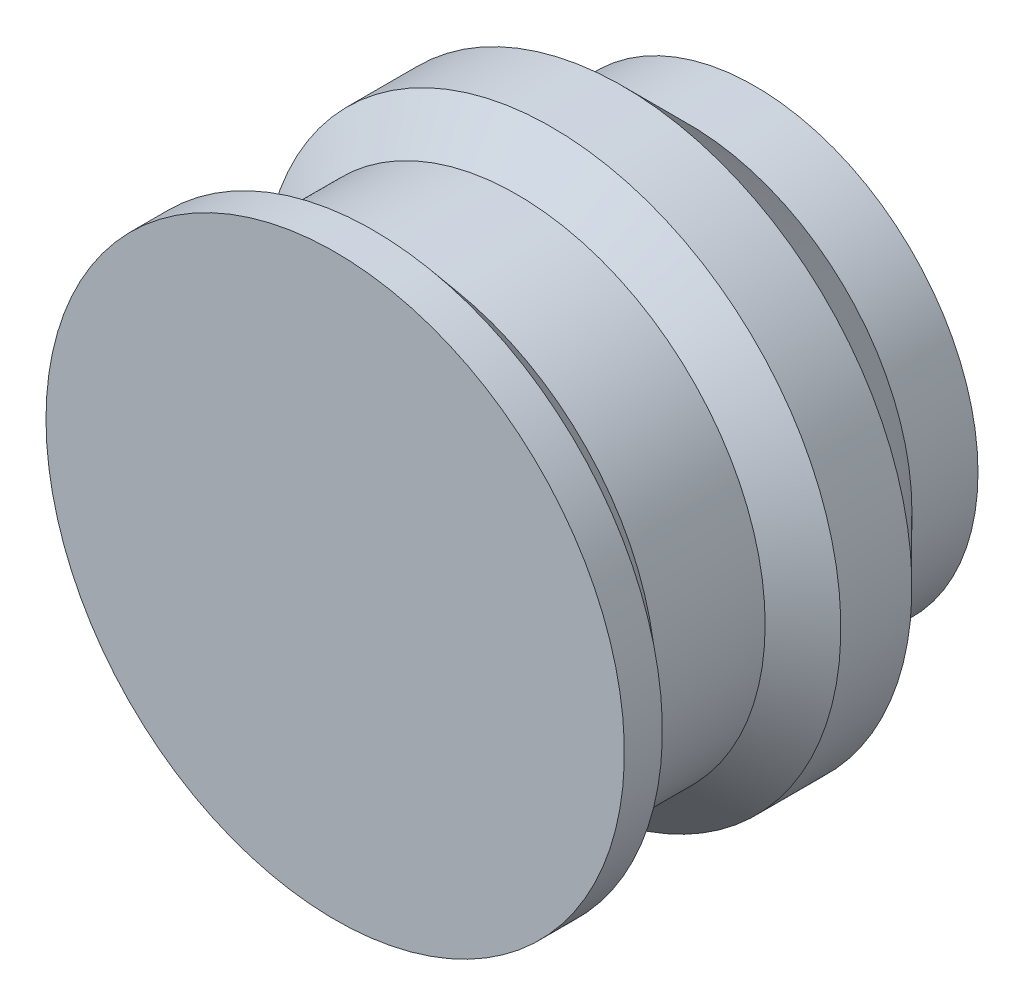
ISO-10303-21;
HEADER;
FILE_DESCRIPTION(('STEP AP214'),'2;1');
FILE_NAME('part.step','',(''),(''),'','','');
FILE_SCHEMA(('AUTOMOTIVE_DESIGN { 1 0 10303 214 1 1 1 1 }'));
ENDSEC;
DATA;
#1=APPLICATION_CONTEXT('core data for automotive mechanical design processes');
#2=APPLICATION_PROTOCOL_DEFINITION('international standard','automotive_design',2000,#1);
#3=PRODUCT_CONTEXT('',#1,'mechanical');
#4=PRODUCT('Part','Part','',(#3));
#5=PRODUCT_RELATED_PRODUCT_CATEGORY('part','',(#4));
#6=PRODUCT_DEFINITION_FORMATION('','',#4);
#7=PRODUCT_DEFINITION_CONTEXT('part definition',#1,'design');
#8=PRODUCT_DEFINITION('design','',#6,#7);
#9=PRODUCT_DEFINITION_SHAPE('','',#8);
#10=(LENGTH_UNIT() NAMED_UNIT(*) SI_UNIT(.MILLI.,.METRE.));
#11=(NAMED_UNIT(*) PLANE_ANGLE_UNIT() SI_UNIT($,.RADIAN.));
#12=(NAMED_UNIT(*) SI_UNIT($,.STERADIAN.) SOLID_ANGLE_UNIT());
#13=UNCERTAINTY_MEASURE_WITH_UNIT(LENGTH_MEASURE(1.E-05),#10,'distance_accuracy_value','');
#14=(GEOMETRIC_REPRESENTATION_CONTEXT(3) GLOBAL_UNCERTAINTY_ASSIGNED_CONTEXT((#13)) GLOBAL_UNIT_ASSIGNED_CONTEXT((#10,
#11,#12)) REPRESENTATION_CONTEXT('',''));
#15=CARTESIAN_POINT('',(0.,0.,0.));
#16=DIRECTION('',(0.,0.,1.));
#17=DIRECTION('',(1.,0.,0.));
#18=AXIS2_PLACEMENT_3D('',#15,#16,#17);
#19=CARTESIAN_POINT('',(0.,0.,3.85));
#20=DIRECTION('',(0.,0.,1.));
#21=DIRECTION('',(1.,0.,0.));
#22=AXIS2_PLACEMENT_3D('',#19,#20,#21);
#23=CYLINDRICAL_SURFACE('',#22,7.51);
#24=CARTESIAN_POINT('',(0.,0.,5.5));
#25=DIRECTION('',(0.,0.,1.));
#26=DIRECTION('',(1.,0.,0.));
#27=AXIS2_PLACEMENT_3D('',#24,#25,#26);
#28=CIRCLE('',#27,7.51);
#29=CARTESIAN_POINT('',(-7.51,0.,5.5));
#30=VERTEX_POINT('',#29);
#31=EDGE_CURVE('E169',#30,#30,#28,.T.);
#32=ORIENTED_EDGE('',*,*,#31,.F.);
#33=DIRECTION('',(0.,0.,-1.));
#34=VECTOR('',#33,1.);
#35=CARTESIAN_POINT('',(-7.51,0.,3.85));
#36=LINE('',#35,#34);
#37=CARTESIAN_POINT('',(-7.51,0.,2.2));
#38=VERTEX_POINT('',#37);
#39=EDGE_CURVE('E9',#30,#38,#36,.T.);
#40=ORIENTED_EDGE('',*,*,#39,.T.);
#41=CARTESIAN_POINT('',(0.,0.,2.2));
#42=DIRECTION('',(0.,0.,1.));
#43=DIRECTION('',(1.,0.,0.));
#44=AXIS2_PLACEMENT_3D('',#41,#42,#43);
#45=CIRCLE('',#44,7.51);
#46=EDGE_CURVE('E178',#38,#38,#45,.T.);
#47=ORIENTED_EDGE('',*,*,#46,.T.);
#48=ORIENTED_EDGE('',*,*,#39,.F.);
#49=EDGE_LOOP('',(#32,#40,#47,#48));
#50=FACE_BOUND('',#49,.T.);
#51=ADVANCED_FACE('F15',(#50),#23,.T.);
#52=CARTESIAN_POINT('',(0.,0.,1.675));
#53=DIRECTION('',(0.,0.,-1.));
#54=DIRECTION('',(1.,0.,0.));
#55=AXIS2_PLACEMENT_3D('',#52,#53,#54);
#56=CONICAL_SURFACE('',#55,8.13,0.86817799306093);
#57=ORIENTED_EDGE('',*,*,#46,.F.);
#58=DIRECTION('',(-0.763152790557396,0.,-0.64621808877844));
#59=VECTOR('',#58,1.);
#60=CARTESIAN_POINT('',(-8.13,0.,1.675));
#61=LINE('',#60,#59);
#62=CARTESIAN_POINT('',(-8.75,0.,1.15));
#63=VERTEX_POINT('',#62);
#64=EDGE_CURVE('E26',#38,#63,#61,.T.);
#65=ORIENTED_EDGE('',*,*,#64,.T.);
#66=CARTESIAN_POINT('',(0.,0.,1.15));
#67=DIRECTION('',(0.,0.,1.));
#68=DIRECTION('',(1.,0.,0.));
#69=AXIS2_PLACEMENT_3D('',#66,#67,#68);
#70=CIRCLE('',#69,8.75);
#71=EDGE_CURVE('E150',#63,#63,#70,.T.);
#72=ORIENTED_EDGE('',*,*,#71,.T.);
#73=ORIENTED_EDGE('',*,*,#64,.F.);
#74=EDGE_LOOP('',(#57,#65,#72,#73));
#75=FACE_BOUND('',#74,.T.);
#76=ADVANCED_FACE('F221',(#75),#56,.T.);
#77=CARTESIAN_POINT('',(0.,0.,7.7));
#78=DIRECTION('',(0.,0.,1.));
#79=DIRECTION('',(1.,0.,0.));
#80=AXIS2_PLACEMENT_3D('',#77,#78,#79);
#81=PLANE('',#80);
#82=CARTESIAN_POINT('',(0.,0.,7.7));
#83=DIRECTION('',(0.,0.,1.));
#84=DIRECTION('',(1.,0.,0.));
#85=AXIS2_PLACEMENT_3D('',#82,#83,#84);
#86=CIRCLE('',#85,8.75);
#87=CARTESIAN_POINT('',(-8.75,0.,7.7));
#88=VERTEX_POINT('',#87);
#89=EDGE_CURVE('E165',#88,#88,#86,.T.);
#90=ORIENTED_EDGE('',*,*,#89,.T.);
#91=EDGE_LOOP('',(#90));
#92=FACE_BOUND('',#91,.T.);
#93=ADVANCED_FACE('F17',(#92),#81,.T.);
#94=CARTESIAN_POINT('',(0.,0.,7.125));
#95=DIRECTION('',(0.,0.,1.));
#96=DIRECTION('',(1.,0.,0.));
#97=AXIS2_PLACEMENT_3D('',#94,#95,#96);
#98=CYLINDRICAL_SURFACE('',#97,8.75);
#99=ORIENTED_EDGE('',*,*,#89,.F.);
#100=DIRECTION('',(0.,0.,-1.));
#101=VECTOR('',#100,1.);
#102=CARTESIAN_POINT('',(-8.75,0.,7.125));
#103=LINE('',#102,#101);
#104=CARTESIAN_POINT('',(-8.75,0.,6.55));
#105=VERTEX_POINT('',#104);
#106=EDGE_CURVE('E168',#88,#105,#103,.T.);
#107=ORIENTED_EDGE('',*,*,#106,.T.);
#108=CARTESIAN_POINT('',(0.,0.,6.55));
#109=DIRECTION('',(0.,0.,1.));
#110=DIRECTION('',(1.,0.,0.));
#111=AXIS2_PLACEMENT_3D('',#108,#109,#110);
#112=CIRCLE('',#111,8.75);
#113=EDGE_CURVE('E171',#105,#105,#112,.T.);
#114=ORIENTED_EDGE('',*,*,#113,.T.);
#115=ORIENTED_EDGE('',*,*,#106,.F.);
#116=EDGE_LOOP('',(#99,#107,#114,#115));
#117=FACE_BOUND('',#116,.T.);
#118=ADVANCED_FACE('F229',(#117),#98,.T.);
#119=CARTESIAN_POINT('',(0.,0.,6.025));
#120=DIRECTION('',(0.,0.,1.));
#121=DIRECTION('',(1.,0.,0.));
#122=AXIS2_PLACEMENT_3D('',#119,#120,#121);
#123=CONICAL_SURFACE('',#122,8.13,0.86817799306093);
#124=ORIENTED_EDGE('',*,*,#113,.F.);
#125=DIRECTION('',(0.763152790557396,0.,-0.64621808877844));
#126=VECTOR('',#125,1.);
#127=CARTESIAN_POINT('',(-8.13,0.,6.025));
#128=LINE('',#127,#126);
#129=EDGE_CURVE('E175',#105,#30,#128,.T.);
#130=ORIENTED_EDGE('',*,*,#129,.T.);
#131=ORIENTED_EDGE('',*,*,#31,.T.);
#132=ORIENTED_EDGE('',*,*,#129,.F.);
#133=EDGE_LOOP('',(#124,#130,#131,#132));
#134=FACE_BOUND('',#133,.T.);
#135=ADVANCED_FACE('F251',(#134),#123,.T.);
#136=CARTESIAN_POINT('',(-1.9,-1.9245,-3.));
#137=DIRECTION('',(-1.,0.,0.));
#138=DIRECTION('',(0.,1.,0.));
#139=AXIS2_PLACEMENT_3D('',#136,#137,#138);
#140=PLANE('',#139);
#141=DIRECTION('',(0.,-1.,0.));
#142=VECTOR('',#141,1.);
#143=CARTESIAN_POINT('',(-1.9,-0.96225,2.));
#144=LINE('',#143,#142);
#145=CARTESIAN_POINT('',(-1.9,1.9245,2.));
#146=VERTEX_POINT('',#145);
#147=CARTESIAN_POINT('',(-1.9,-1.9245,2.));
#148=VERTEX_POINT('',#147);
#149=EDGE_CURVE('E125',#146,#148,#144,.T.);
#150=ORIENTED_EDGE('',*,*,#149,.T.);
#151=DIRECTION('',(0.,0.,-1.));
#152=VECTOR('',#151,1.);
#153=CARTESIAN_POINT('',(-1.9,-1.9245,-3.));
#154=LINE('',#153,#152);
#155=CARTESIAN_POINT('',(-1.9,-1.9245,-5.));
#156=VERTEX_POINT('',#155);
#157=EDGE_CURVE('E118',#148,#156,#154,.T.);
#158=ORIENTED_EDGE('',*,*,#157,.T.);
#159=DIRECTION('',(0.,-1.,0.));
#160=VECTOR('',#159,1.);
#161=CARTESIAN_POINT('',(-1.9,-0.96225,-5.));
#162=LINE('',#161,#160);
#163=CARTESIAN_POINT('',(-1.9,1.9245,-5.));
#164=VERTEX_POINT('',#163);
#165=EDGE_CURVE('E91',#164,#156,#162,.T.);
#166=ORIENTED_EDGE('',*,*,#165,.F.);
#167=DIRECTION('',(0.,0.,1.));
#168=VECTOR('',#167,1.);
#169=CARTESIAN_POINT('',(-1.9,1.9245,-3.));
#170=LINE('',#169,#168);
#171=EDGE_CURVE('E135',#164,#146,#170,.T.);
#172=ORIENTED_EDGE('',*,*,#171,.T.);
#173=EDGE_LOOP('',(#150,#158,#166,#172));
#174=FACE_BOUND('',#173,.T.);
#175=ADVANCED_FACE('F243',(#174),#140,.F.);
#176=CARTESIAN_POINT('',(0.,-0.398741887905605,-3.));
#177=DIRECTION('',(0.,0.,-1.));
#178=DIRECTION('',(-0.633071265484004,0.774093516843077,0.));
#179=AXIS2_PLACEMENT_3D('',#176,#177,#178);
#180=CYLINDRICAL_SURFACE('',#179,3.0012418879056);
#181=CARTESIAN_POINT('',(0.,-0.398741887905605,2.));
#182=DIRECTION('',(0.,0.,1.));
#183=DIRECTION('',(-0.633071265484004,0.774093516843077,0.));
#184=AXIS2_PLACEMENT_3D('',#181,#182,#183);
#185=CIRCLE('',#184,3.0012418879056);
#186=CARTESIAN_POINT('',(1.9,1.9245,2.));
#187=VERTEX_POINT('',#186);
#188=EDGE_CURVE('E158',#187,#146,#185,.T.);
#189=ORIENTED_EDGE('',*,*,#188,.T.);
#190=ORIENTED_EDGE('',*,*,#171,.F.);
#191=CARTESIAN_POINT('',(0.,-0.398741887905605,-5.));
#192=DIRECTION('',(0.,0.,1.));
#193=DIRECTION('',(-0.633071265484004,0.774093516843077,0.));
#194=AXIS2_PLACEMENT_3D('',#191,#192,#193);
#195=CIRCLE('',#194,3.0012418879056);
#196=CARTESIAN_POINT('',(1.9,1.9245,-5.));
#197=VERTEX_POINT('',#196);
#198=EDGE_CURVE('E144',#197,#164,#195,.T.);
#199=ORIENTED_EDGE('',*,*,#198,.F.);
#200=DIRECTION('',(0.,0.,-1.));
#201=VECTOR('',#200,1.);
#202=CARTESIAN_POINT('',(1.9,1.9245,-3.));
#203=LINE('',#202,#201);
#204=EDGE_CURVE('E109',#187,#197,#203,.T.);
#205=ORIENTED_EDGE('',*,*,#204,.F.);
#206=EDGE_LOOP('',(#189,#190,#199,#205));
#207=FACE_BOUND('',#206,.T.);
#208=ADVANCED_FACE('F240',(#207),#180,.F.);
#209=CARTESIAN_POINT('',(0.,0.,0.575));
#210=DIRECTION('',(0.,0.,1.));
#211=DIRECTION('',(1.,0.,0.));
#212=AXIS2_PLACEMENT_3D('',#209,#210,#211);
#213=CYLINDRICAL_SURFACE('',#212,8.75);
#214=ORIENTED_EDGE('',*,*,#71,.F.);
#215=DIRECTION('',(0.,0.,-1.));
#216=VECTOR('',#215,1.);
#217=CARTESIAN_POINT('',(-8.75,0.,0.575));
#218=LINE('',#217,#216);
#219=CARTESIAN_POINT('',(-8.75,0.,-1.));
#220=VERTEX_POINT('',#219);
#221=EDGE_CURVE('E154',#63,#220,#218,.T.);
#222=ORIENTED_EDGE('',*,*,#221,.T.);
#223=CARTESIAN_POINT('',(0.,0.,-1.));
#224=DIRECTION('',(0.,0.,-1.));
#225=DIRECTION('',(1.,0.,0.));
#226=AXIS2_PLACEMENT_3D('',#223,#224,#225);
#227=CIRCLE('',#226,8.75);
#228=EDGE_CURVE('E139',#220,#220,#227,.T.);
#229=ORIENTED_EDGE('',*,*,#228,.F.);
#230=ORIENTED_EDGE('',*,*,#221,.F.);
#231=EDGE_LOOP('',(#214,#222,#229,#230));
#232=FACE_BOUND('',#231,.T.);
#233=ADVANCED_FACE('F219',(#232),#213,.T.);
#234=CARTESIAN_POINT('',(0.,0.,-2.));
#235=DIRECTION('',(0.,0.,1.));
#236=DIRECTION('',(1.,0.,0.));
#237=AXIS2_PLACEMENT_3D('',#234,#235,#236);
#238=CONICAL_SURFACE('',#237,7.75,0.785398163397448);
#239=ORIENTED_EDGE('',*,*,#228,.T.);
#240=DIRECTION('',(0.707106781186547,0.,-0.707106781186548));
#241=VECTOR('',#240,1.);
#242=CARTESIAN_POINT('',(-7.75,0.,-2.));
#243=LINE('',#242,#241);
#244=CARTESIAN_POINT('',(-6.75,0.,-3.));
#245=VERTEX_POINT('',#244);
#246=EDGE_CURVE('E143',#220,#245,#243,.T.);
#247=ORIENTED_EDGE('',*,*,#246,.T.);
#248=CARTESIAN_POINT('',(0.,0.,-3.));
#249=DIRECTION('',(0.,0.,1.));
#250=DIRECTION('',(1.,0.,0.));
#251=AXIS2_PLACEMENT_3D('',#248,#249,#250);
#252=CIRCLE('',#251,6.75);
#253=EDGE_CURVE('E145',#245,#245,#252,.T.);
#254=ORIENTED_EDGE('',*,*,#253,.T.);
#255=ORIENTED_EDGE('',*,*,#246,.F.);
#256=EDGE_LOOP('',(#239,#247,#254,#255));
#257=FACE_BOUND('',#256,.T.);
#258=ADVANCED_FACE('F211',(#257),#238,.T.);
#259=CARTESIAN_POINT('',(8.75,0.,-5.));
#260=DIRECTION('',(0.,0.,-1.));
#261=DIRECTION('',(0.,-1.,0.));
#262=AXIS2_PLACEMENT_3D('',#259,#260,#261);
#263=PLANE('',#262);
#264=ORIENTED_EDGE('',*,*,#165,.T.);
#265=CARTESIAN_POINT('',(0.,0.398741887905603,-5.));
#266=DIRECTION('',(0.,0.,1.));
#267=DIRECTION('',(0.633071265484003,-0.774093516843077,0.));
#268=AXIS2_PLACEMENT_3D('',#265,#266,#267);
#269=CIRCLE('',#268,3.0012418879056);
#270=CARTESIAN_POINT('',(1.9,-1.9245,-5.));
#271=VERTEX_POINT('',#270);
#272=EDGE_CURVE('E113',#156,#271,#269,.T.);
#273=ORIENTED_EDGE('',*,*,#272,.T.);
#274=DIRECTION('',(0.,1.,0.));
#275=VECTOR('',#274,1.);
#276=CARTESIAN_POINT('',(1.9,0.96225,-5.));
#277=LINE('',#276,#275);
#278=EDGE_CURVE('E102',#271,#197,#277,.T.);
#279=ORIENTED_EDGE('',*,*,#278,.T.);
#280=ORIENTED_EDGE('',*,*,#198,.T.);
#281=EDGE_LOOP('',(#264,#273,#279,#280));
#282=FACE_BOUND('',#281,.T.);
#283=CARTESIAN_POINT('',(0.,0.,-5.));
#284=DIRECTION('',(0.,0.,-1.));
#285=DIRECTION('',(1.,0.,0.));
#286=AXIS2_PLACEMENT_3D('',#283,#284,#285);
#287=CIRCLE('',#286,6.75);
#288=CARTESIAN_POINT('',(-6.75,0.,-5.));
#289=VERTEX_POINT('',#288);
#290=EDGE_CURVE('E19',#289,#289,#287,.T.);
#291=ORIENTED_EDGE('',*,*,#290,.T.);
#292=EDGE_LOOP('',(#291));
#293=FACE_BOUND('',#292,.T.);
#294=ADVANCED_FACE('F114',(#282,#293),#263,.T.);
#295=CARTESIAN_POINT('',(0.,0.,-3.));
#296=DIRECTION('',(0.,0.,-1.));
#297=DIRECTION('',(1.,0.,0.));
#298=AXIS2_PLACEMENT_3D('',#295,#296,#297);
#299=CYLINDRICAL_SURFACE('',#298,6.75);
#300=ORIENTED_EDGE('',*,*,#290,.F.);
#301=DIRECTION('',(0.,0.,1.));
#302=VECTOR('',#301,1.);
#303=CARTESIAN_POINT('',(-6.75,0.,-3.));
#304=LINE('',#303,#302);
#305=EDGE_CURVE('E148',#289,#245,#304,.T.);
#306=ORIENTED_EDGE('',*,*,#305,.T.);
#307=ORIENTED_EDGE('',*,*,#253,.F.);
#308=ORIENTED_EDGE('',*,*,#305,.F.);
#309=EDGE_LOOP('',(#300,#306,#307,#308));
#310=FACE_BOUND('',#309,.T.);
#311=ADVANCED_FACE('F234',(#310),#299,.T.);
#312=CARTESIAN_POINT('',(1.9,1.9245,-3.));
#313=DIRECTION('',(1.,0.,0.));
#314=DIRECTION('',(0.,-1.,0.));
#315=AXIS2_PLACEMENT_3D('',#312,#313,#314);
#316=PLANE('',#315);
#317=DIRECTION('',(0.,1.,0.));
#318=VECTOR('',#317,1.);
#319=CARTESIAN_POINT('',(1.9,0.96225,2.));
#320=LINE('',#319,#318);
#321=CARTESIAN_POINT('',(1.9,-1.9245,2.));
#322=VERTEX_POINT('',#321);
#323=EDGE_CURVE('E155',#322,#187,#320,.T.);
#324=ORIENTED_EDGE('',*,*,#323,.T.);
#325=ORIENTED_EDGE('',*,*,#204,.T.);
#326=ORIENTED_EDGE('',*,*,#278,.F.);
#327=DIRECTION('',(0.,0.,-1.));
#328=VECTOR('',#327,1.);
#329=CARTESIAN_POINT('',(1.9,-1.9245,-3.));
#330=LINE('',#329,#328);
#331=EDGE_CURVE('E106',#322,#271,#330,.T.);
#332=ORIENTED_EDGE('',*,*,#331,.F.);
#333=EDGE_LOOP('',(#324,#325,#326,#332));
#334=FACE_BOUND('',#333,.T.);
#335=ADVANCED_FACE('F104',(#334),#316,.F.);
#336=CARTESIAN_POINT('',(0.,0.398741887905603,-3.));
#337=DIRECTION('',(0.,0.,-1.));
#338=DIRECTION('',(0.633071265484003,-0.774093516843077,0.));
#339=AXIS2_PLACEMENT_3D('',#336,#337,#338);
#340=CYLINDRICAL_SURFACE('',#339,3.0012418879056);
#341=CARTESIAN_POINT('',(0.,0.398741887905603,2.));
#342=DIRECTION('',(0.,0.,1.));
#343=DIRECTION('',(0.633071265484003,-0.774093516843077,0.));
#344=AXIS2_PLACEMENT_3D('',#341,#342,#343);
#345=CIRCLE('',#344,3.0012418879056);
#346=EDGE_CURVE('E122',#148,#322,#345,.T.);
#347=ORIENTED_EDGE('',*,*,#346,.T.);
#348=ORIENTED_EDGE('',*,*,#331,.T.);
#349=ORIENTED_EDGE('',*,*,#272,.F.);
#350=ORIENTED_EDGE('',*,*,#157,.F.);
#351=EDGE_LOOP('',(#347,#348,#349,#350));
#352=FACE_BOUND('',#351,.T.);
#353=ADVANCED_FACE('F120',(#352),#340,.F.);
#354=CARTESIAN_POINT('',(0.,0.,2.));
#355=DIRECTION('',(0.,0.,-1.));
#356=DIRECTION('',(0.,-1.,0.));
#357=AXIS2_PLACEMENT_3D('',#354,#355,#356);
#358=PLANE('',#357);
#359=ORIENTED_EDGE('',*,*,#188,.F.);
#360=ORIENTED_EDGE('',*,*,#323,.F.);
#361=ORIENTED_EDGE('',*,*,#346,.F.);
#362=ORIENTED_EDGE('',*,*,#149,.F.);
#363=EDGE_LOOP('',(#359,#360,#361,#362));
#364=FACE_BOUND('',#363,.T.);
#365=ADVANCED_FACE('F236',(#364),#358,.T.);
#366=CLOSED_SHELL('',(#51,#76,#93,#118,#135,#175,#208,#233,#258,#294,#311,#335,#353,#365));
#367=MANIFOLD_SOLID_BREP('B1',#366);
#368=ADVANCED_BREP_SHAPE_REPRESENTATION('',(#18,#367),#14);
#369=SHAPE_DEFINITION_REPRESENTATION(#9,#368);
ENDSEC;
END-ISO-10303-21;
